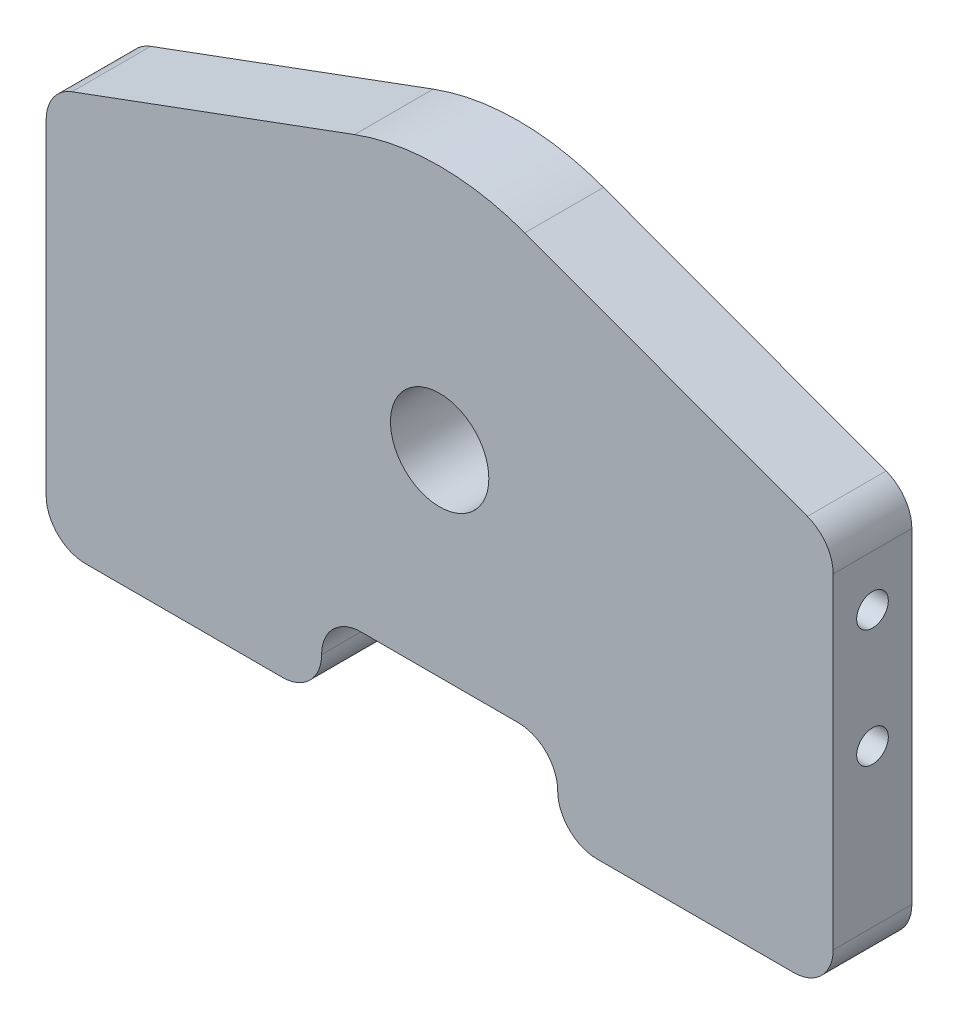
ISO-10303-21;
HEADER;
FILE_DESCRIPTION(('STEP AP214'),'2;1');
FILE_NAME('part.step','',(''),(''),'','','');
FILE_SCHEMA(('AUTOMOTIVE_DESIGN { 1 0 10303 214 1 1 1 1 }'));
ENDSEC;
DATA;
#1=APPLICATION_CONTEXT('core data for automotive mechanical design processes');
#2=APPLICATION_PROTOCOL_DEFINITION('international standard','automotive_design',2000,#1);
#3=PRODUCT_CONTEXT('',#1,'mechanical');
#4=PRODUCT('Part','Part','',(#3));
#5=PRODUCT_RELATED_PRODUCT_CATEGORY('part','',(#4));
#6=PRODUCT_DEFINITION_FORMATION('','',#4);
#7=PRODUCT_DEFINITION_CONTEXT('part definition',#1,'design');
#8=PRODUCT_DEFINITION('design','',#6,#7);
#9=PRODUCT_DEFINITION_SHAPE('','',#8);
#10=(LENGTH_UNIT() NAMED_UNIT(*) SI_UNIT(.MILLI.,.METRE.));
#11=(NAMED_UNIT(*) PLANE_ANGLE_UNIT() SI_UNIT($,.RADIAN.));
#12=(NAMED_UNIT(*) SI_UNIT($,.STERADIAN.) SOLID_ANGLE_UNIT());
#13=UNCERTAINTY_MEASURE_WITH_UNIT(LENGTH_MEASURE(1.E-05),#10,'distance_accuracy_value','');
#14=(GEOMETRIC_REPRESENTATION_CONTEXT(3) GLOBAL_UNCERTAINTY_ASSIGNED_CONTEXT((#13)) GLOBAL_UNIT_ASSIGNED_CONTEXT((#10,
#11,#12)) REPRESENTATION_CONTEXT('',''));
#15=CARTESIAN_POINT('',(0.,0.,0.));
#16=DIRECTION('',(0.,0.,1.));
#17=DIRECTION('',(1.,0.,0.));
#18=AXIS2_PLACEMENT_3D('',#15,#16,#17);
#19=CARTESIAN_POINT('',(-63.5,0.,12.7));
#20=DIRECTION('',(0.,1.,0.));
#21=DIRECTION('',(0.,0.,1.));
#22=AXIS2_PLACEMENT_3D('',#19,#20,#21);
#23=PLANE('',#22);
#24=DIRECTION('',(1.,0.,0.));
#25=VECTOR('',#24,1.);
#26=CARTESIAN_POINT('',(-63.5,0.,12.7));
#27=LINE('',#26,#25);
#28=CARTESIAN_POINT('',(-57.15,0.,12.7));
#29=VERTEX_POINT('',#28);
#30=CARTESIAN_POINT('',(-25.4,0.,12.7));
#31=VERTEX_POINT('',#30);
#32=EDGE_CURVE('E228',#29,#31,#27,.T.);
#33=ORIENTED_EDGE('',*,*,#32,.F.);
#34=DIRECTION('',(0.,0.,-1.));
#35=VECTOR('',#34,1.);
#36=CARTESIAN_POINT('',(-57.15,0.,12.7));
#37=LINE('',#36,#35);
#38=CARTESIAN_POINT('',(-57.15,0.,0.));
#39=VERTEX_POINT('',#38);
#40=EDGE_CURVE('E281',#29,#39,#37,.T.);
#41=ORIENTED_EDGE('',*,*,#40,.T.);
#42=DIRECTION('',(1.,0.,0.));
#43=VECTOR('',#42,1.);
#44=CARTESIAN_POINT('',(-63.5,0.,0.));
#45=LINE('',#44,#43);
#46=CARTESIAN_POINT('',(-25.4,0.,0.));
#47=VERTEX_POINT('',#46);
#48=EDGE_CURVE('E236',#39,#47,#45,.T.);
#49=ORIENTED_EDGE('',*,*,#48,.T.);
#50=DIRECTION('',(0.,0.,1.));
#51=VECTOR('',#50,1.);
#52=CARTESIAN_POINT('',(-25.4,0.,12.7));
#53=LINE('',#52,#51);
#54=EDGE_CURVE('E279',#47,#31,#53,.T.);
#55=ORIENTED_EDGE('',*,*,#54,.T.);
#56=EDGE_LOOP('',(#33,#41,#49,#55));
#57=FACE_BOUND('',#56,.T.);
#58=ADVANCED_FACE('F33',(#57),#23,.F.);
#59=CARTESIAN_POINT('',(63.5,0.,12.7));
#60=DIRECTION('',(-1.,0.,0.));
#61=DIRECTION('',(0.,0.,1.));
#62=AXIS2_PLACEMENT_3D('',#59,#60,#61);
#63=PLANE('',#62);
#64=CARTESIAN_POINT('',(63.5,50.7135001190819,6.35));
#65=DIRECTION('',(1.,0.,0.));
#66=DIRECTION('',(0.,0.,-1.));
#67=AXIS2_PLACEMENT_3D('',#64,#65,#66);
#68=CIRCLE('',#67,2.55269999999999);
#69=CARTESIAN_POINT('',(63.5,50.7135001190819,3.79730000000001));
#70=VERTEX_POINT('',#69);
#71=EDGE_CURVE('E182',#70,#70,#68,.T.);
#72=ORIENTED_EDGE('',*,*,#71,.F.);
#73=EDGE_LOOP('',(#72));
#74=FACE_BOUND('',#73,.T.);
#75=CARTESIAN_POINT('',(63.5,31.6635001190819,6.35));
#76=DIRECTION('',(1.,0.,0.));
#77=DIRECTION('',(0.,0.,-1.));
#78=AXIS2_PLACEMENT_3D('',#75,#76,#77);
#79=CIRCLE('',#78,2.55269999999999);
#80=CARTESIAN_POINT('',(63.5,31.6635001190819,3.79730000000001));
#81=VERTEX_POINT('',#80);
#82=EDGE_CURVE('E188',#81,#81,#79,.T.);
#83=ORIENTED_EDGE('',*,*,#82,.F.);
#84=EDGE_LOOP('',(#83));
#85=FACE_BOUND('',#84,.T.);
#86=DIRECTION('',(0.,1.,0.));
#87=VECTOR('',#86,1.);
#88=CARTESIAN_POINT('',(63.5,0.,12.7));
#89=LINE('',#88,#87);
#90=CARTESIAN_POINT('',(63.5,6.35,12.7));
#91=VERTEX_POINT('',#90);
#92=CARTESIAN_POINT('',(63.5,58.9011925682668,12.7));
#93=VERTEX_POINT('',#92);
#94=EDGE_CURVE('E229',#91,#93,#89,.T.);
#95=ORIENTED_EDGE('',*,*,#94,.F.);
#96=DIRECTION('',(0.,0.,-1.));
#97=VECTOR('',#96,1.);
#98=CARTESIAN_POINT('',(63.5,6.35,12.7));
#99=LINE('',#98,#97);
#100=CARTESIAN_POINT('',(63.5,6.35,0.));
#101=VERTEX_POINT('',#100);
#102=EDGE_CURVE('E274',#91,#101,#99,.T.);
#103=ORIENTED_EDGE('',*,*,#102,.T.);
#104=DIRECTION('',(0.,1.,0.));
#105=VECTOR('',#104,1.);
#106=CARTESIAN_POINT('',(63.5,0.,0.));
#107=LINE('',#106,#105);
#108=CARTESIAN_POINT('',(63.5,58.9011925682668,0.));
#109=VERTEX_POINT('',#108);
#110=EDGE_CURVE('E225',#101,#109,#107,.T.);
#111=ORIENTED_EDGE('',*,*,#110,.T.);
#112=DIRECTION('',(0.,0.,1.));
#113=VECTOR('',#112,1.);
#114=CARTESIAN_POINT('',(63.5,58.9011925682669,12.7));
#115=LINE('',#114,#113);
#116=EDGE_CURVE('E271',#109,#93,#115,.T.);
#117=ORIENTED_EDGE('',*,*,#116,.T.);
#118=EDGE_LOOP('',(#95,#103,#111,#117));
#119=FACE_BOUND('',#118,.T.);
#120=ADVANCED_FACE('F325',(#74,#85,#119),#63,.F.);
#121=CARTESIAN_POINT('',(-63.5,0.,12.7));
#122=DIRECTION('',(1.,0.,0.));
#123=DIRECTION('',(0.,0.,-1.));
#124=AXIS2_PLACEMENT_3D('',#121,#122,#123);
#125=PLANE('',#124);
#126=CARTESIAN_POINT('',(-63.5,50.7135001190819,6.35));
#127=DIRECTION('',(-1.,0.,0.));
#128=DIRECTION('',(0.,0.,1.));
#129=AXIS2_PLACEMENT_3D('',#126,#127,#128);
#130=CIRCLE('',#129,2.55269999999999);
#131=CARTESIAN_POINT('',(-63.5,50.7135001190819,8.90269999999999));
#132=VERTEX_POINT('',#131);
#133=EDGE_CURVE('E170',#132,#132,#130,.T.);
#134=ORIENTED_EDGE('',*,*,#133,.F.);
#135=EDGE_LOOP('',(#134));
#136=FACE_BOUND('',#135,.T.);
#137=CARTESIAN_POINT('',(-63.5,31.6635001190819,6.35));
#138=DIRECTION('',(-1.,0.,0.));
#139=DIRECTION('',(0.,0.,1.));
#140=AXIS2_PLACEMENT_3D('',#137,#138,#139);
#141=CIRCLE('',#140,2.55269999999999);
#142=CARTESIAN_POINT('',(-63.5,31.6635001190819,8.90269999999999));
#143=VERTEX_POINT('',#142);
#144=EDGE_CURVE('E169',#143,#143,#141,.T.);
#145=ORIENTED_EDGE('',*,*,#144,.F.);
#146=EDGE_LOOP('',(#145));
#147=FACE_BOUND('',#146,.T.);
#148=DIRECTION('',(0.,-1.,0.));
#149=VECTOR('',#148,1.);
#150=CARTESIAN_POINT('',(-63.5,0.,0.));
#151=LINE('',#150,#149);
#152=CARTESIAN_POINT('',(-63.5,58.9011925682667,0.));
#153=VERTEX_POINT('',#152);
#154=CARTESIAN_POINT('',(-63.5,6.35,0.));
#155=VERTEX_POINT('',#154);
#156=EDGE_CURVE('E218',#153,#155,#151,.T.);
#157=ORIENTED_EDGE('',*,*,#156,.T.);
#158=DIRECTION('',(0.,0.,-1.));
#159=VECTOR('',#158,1.);
#160=CARTESIAN_POINT('',(-63.5,6.35,12.7));
#161=LINE('',#160,#159);
#162=CARTESIAN_POINT('',(-63.5,6.35,12.7));
#163=VERTEX_POINT('',#162);
#164=EDGE_CURVE('E286',#155,#163,#161,.F.);
#165=ORIENTED_EDGE('',*,*,#164,.T.);
#166=DIRECTION('',(0.,-1.,0.));
#167=VECTOR('',#166,1.);
#168=CARTESIAN_POINT('',(-63.5,0.,12.7));
#169=LINE('',#168,#167);
#170=CARTESIAN_POINT('',(-63.5,58.9011925682667,12.7));
#171=VERTEX_POINT('',#170);
#172=EDGE_CURVE('E221',#171,#163,#169,.T.);
#173=ORIENTED_EDGE('',*,*,#172,.F.);
#174=DIRECTION('',(0.,0.,1.));
#175=VECTOR('',#174,1.);
#176=CARTESIAN_POINT('',(-63.5,58.9011925682667,12.7));
#177=LINE('',#176,#175);
#178=EDGE_CURVE('E284',#171,#153,#177,.F.);
#179=ORIENTED_EDGE('',*,*,#178,.T.);
#180=EDGE_LOOP('',(#157,#165,#173,#179));
#181=FACE_BOUND('',#180,.T.);
#182=ADVANCED_FACE('F350',(#136,#147,#181),#125,.F.);
#183=CARTESIAN_POINT('',(25.4,0.,12.7));
#184=VERTEX_POINT('',#183);
#185=CARTESIAN_POINT('',(57.15,0.,12.7));
#186=VERTEX_POINT('',#185);
#187=EDGE_CURVE('E224',#184,#186,#27,.T.);
#188=ORIENTED_EDGE('',*,*,#187,.F.);
#189=DIRECTION('',(0.,0.,1.));
#190=VECTOR('',#189,1.);
#191=CARTESIAN_POINT('',(25.4,0.,12.7));
#192=LINE('',#191,#190);
#193=CARTESIAN_POINT('',(25.4,0.,0.));
#194=VERTEX_POINT('',#193);
#195=EDGE_CURVE('E259',#184,#194,#192,.F.);
#196=ORIENTED_EDGE('',*,*,#195,.T.);
#197=CARTESIAN_POINT('',(57.15,0.,0.));
#198=VERTEX_POINT('',#197);
#199=EDGE_CURVE('E235',#194,#198,#45,.T.);
#200=ORIENTED_EDGE('',*,*,#199,.T.);
#201=DIRECTION('',(0.,0.,-1.));
#202=VECTOR('',#201,1.);
#203=CARTESIAN_POINT('',(57.15,0.,12.7));
#204=LINE('',#203,#202);
#205=EDGE_CURVE('E257',#198,#186,#204,.F.);
#206=ORIENTED_EDGE('',*,*,#205,.T.);
#207=EDGE_LOOP('',(#188,#196,#200,#206));
#208=FACE_BOUND('',#207,.T.);
#209=ADVANCED_FACE('F317',(#208),#23,.F.);
#210=CARTESIAN_POINT('',(0.,0.,12.7));
#211=DIRECTION('',(0.,0.,-1.));
#212=DIRECTION('',(-1.,0.,0.));
#213=AXIS2_PLACEMENT_3D('',#210,#211,#212);
#214=PLANE('',#213);
#215=CARTESIAN_POINT('',(0.,44.4499999999997,12.7));
#216=DIRECTION('',(0.,0.,1.));
#217=DIRECTION('',(1.,0.,0.));
#218=AXIS2_PLACEMENT_3D('',#215,#216,#217);
#219=CIRCLE('',#218,7.9375);
#220=CARTESIAN_POINT('',(7.93749999999995,44.4499999999997,12.7));
#221=VERTEX_POINT('',#220);
#222=EDGE_CURVE('E194',#221,#221,#219,.T.);
#223=ORIENTED_EDGE('',*,*,#222,.F.);
#224=EDGE_LOOP('',(#223));
#225=FACE_BOUND('',#224,.T.);
#226=DIRECTION('',(-1.,0.,0.));
#227=VECTOR('',#226,1.);
#228=CARTESIAN_POINT('',(-19.05,12.7,12.7));
#229=LINE('',#228,#227);
#230=CARTESIAN_POINT('',(12.7,12.7,12.7));
#231=VERTEX_POINT('',#230);
#232=CARTESIAN_POINT('',(-12.7,12.7,12.7));
#233=VERTEX_POINT('',#232);
#234=EDGE_CURVE('E297',#231,#233,#229,.T.);
#235=ORIENTED_EDGE('',*,*,#234,.F.);
#236=CARTESIAN_POINT('',(12.7,6.35,12.7));
#237=DIRECTION('',(0.,0.,-1.));
#238=DIRECTION('',(-1.,0.,0.));
#239=AXIS2_PLACEMENT_3D('',#236,#237,#238);
#240=CIRCLE('',#239,6.35);
#241=CARTESIAN_POINT('',(19.05,6.35,12.7));
#242=VERTEX_POINT('',#241);
#243=EDGE_CURVE('E42',#231,#242,#240,.T.);
#244=ORIENTED_EDGE('',*,*,#243,.T.);
#245=CARTESIAN_POINT('',(25.4,6.35,12.7));
#246=DIRECTION('',(0.,0.,-1.));
#247=DIRECTION('',(-1.,0.,0.));
#248=AXIS2_PLACEMENT_3D('',#245,#246,#247);
#249=CIRCLE('',#248,6.35);
#250=EDGE_CURVE('E255',#242,#184,#249,.F.);
#251=ORIENTED_EDGE('',*,*,#250,.T.);
#252=ORIENTED_EDGE('',*,*,#187,.T.);
#253=CARTESIAN_POINT('',(57.15,6.35,12.7));
#254=DIRECTION('',(0.,0.,-1.));
#255=DIRECTION('',(-1.,0.,0.));
#256=AXIS2_PLACEMENT_3D('',#253,#254,#255);
#257=CIRCLE('',#256,6.35);
#258=EDGE_CURVE('E253',#186,#91,#257,.F.);
#259=ORIENTED_EDGE('',*,*,#258,.T.);
#260=ORIENTED_EDGE('',*,*,#94,.T.);
#261=CARTESIAN_POINT('',(57.15,58.9011925682669,12.7));
#262=DIRECTION('',(0.,0.,-1.));
#263=DIRECTION('',(-1.,0.,0.));
#264=AXIS2_PLACEMENT_3D('',#261,#262,#263);
#265=CIRCLE('',#264,6.35);
#266=CARTESIAN_POINT('',(59.3477117665924,64.8587560795507,12.7));
#267=VERTEX_POINT('',#266);
#268=EDGE_CURVE('E251',#93,#267,#265,.F.);
#269=ORIENTED_EDGE('',*,*,#268,.T.);
#270=DIRECTION('',(-0.938198978154946,0.346096341195649,0.));
#271=VECTOR('',#270,1.);
#272=CARTESIAN_POINT('',(28.1689350770747,76.3604319355824,12.7));
#273=LINE('',#272,#271);
#274=CARTESIAN_POINT('',(13.7356985412023,81.6847719455241,12.7));
#275=VERTEX_POINT('',#274);
#276=EDGE_CURVE('E212',#267,#275,#273,.T.);
#277=ORIENTED_EDGE('',*,*,#276,.T.);
#278=CARTESIAN_POINT('',(0.,44.4499999999997,12.7));
#279=DIRECTION('',(0.,0.,1.));
#280=DIRECTION('',(1.,0.,0.));
#281=AXIS2_PLACEMENT_3D('',#278,#279,#280);
#282=CIRCLE('',#281,39.6875);
#283=CARTESIAN_POINT('',(-13.7356985412025,81.684771945524,12.7));
#284=VERTEX_POINT('',#283);
#285=EDGE_CURVE('E198',#275,#284,#282,.T.);
#286=ORIENTED_EDGE('',*,*,#285,.T.);
#287=DIRECTION('',(0.938198978154945,0.346096341195652,0.));
#288=VECTOR('',#287,1.);
#289=CARTESIAN_POINT('',(-28.1689350770749,76.3604319355823,12.7));
#290=LINE('',#289,#288);
#291=CARTESIAN_POINT('',(-59.3477117665924,64.8587560795506,12.7));
#292=VERTEX_POINT('',#291);
#293=EDGE_CURVE('E205',#292,#284,#290,.T.);
#294=ORIENTED_EDGE('',*,*,#293,.F.);
#295=CARTESIAN_POINT('',(-57.15,58.9011925682667,12.7));
#296=DIRECTION('',(0.,0.,-1.));
#297=DIRECTION('',(-1.,0.,0.));
#298=AXIS2_PLACEMENT_3D('',#295,#296,#297);
#299=CIRCLE('',#298,6.35);
#300=EDGE_CURVE('E245',#292,#171,#299,.F.);
#301=ORIENTED_EDGE('',*,*,#300,.T.);
#302=ORIENTED_EDGE('',*,*,#172,.T.);
#303=CARTESIAN_POINT('',(-57.15,6.35,12.7));
#304=DIRECTION('',(0.,0.,-1.));
#305=DIRECTION('',(-1.,0.,0.));
#306=AXIS2_PLACEMENT_3D('',#303,#304,#305);
#307=CIRCLE('',#306,6.35);
#308=EDGE_CURVE('E249',#163,#29,#307,.F.);
#309=ORIENTED_EDGE('',*,*,#308,.T.);
#310=ORIENTED_EDGE('',*,*,#32,.T.);
#311=CARTESIAN_POINT('',(-25.4,6.35,12.7));
#312=DIRECTION('',(0.,0.,-1.));
#313=DIRECTION('',(-1.,0.,0.));
#314=AXIS2_PLACEMENT_3D('',#311,#312,#313);
#315=CIRCLE('',#314,6.35);
#316=CARTESIAN_POINT('',(-19.05,6.35,12.7));
#317=VERTEX_POINT('',#316);
#318=EDGE_CURVE('E247',#31,#317,#315,.F.);
#319=ORIENTED_EDGE('',*,*,#318,.T.);
#320=CARTESIAN_POINT('',(-12.7,6.35,12.7));
#321=DIRECTION('',(0.,0.,-1.));
#322=DIRECTION('',(-1.,0.,0.));
#323=AXIS2_PLACEMENT_3D('',#320,#321,#322);
#324=CIRCLE('',#323,6.35);
#325=EDGE_CURVE('E291',#317,#233,#324,.T.);
#326=ORIENTED_EDGE('',*,*,#325,.T.);
#327=EDGE_LOOP('',(#235,#244,#251,#252,#259,#260,#269,#277,#286,#294,#301,#302,#309,#310,#319,#326));
#328=FACE_BOUND('',#327,.T.);
#329=ADVANCED_FACE('F314',(#225,#328),#214,.F.);
#330=CARTESIAN_POINT('',(0.,0.,0.));
#331=DIRECTION('',(0.,0.,-1.));
#332=DIRECTION('',(-1.,0.,0.));
#333=AXIS2_PLACEMENT_3D('',#330,#331,#332);
#334=PLANE('',#333);
#335=ORIENTED_EDGE('',*,*,#199,.F.);
#336=CARTESIAN_POINT('',(25.4,6.35,0.));
#337=DIRECTION('',(0.,0.,-1.));
#338=DIRECTION('',(-1.,0.,0.));
#339=AXIS2_PLACEMENT_3D('',#336,#337,#338);
#340=CIRCLE('',#339,6.35);
#341=CARTESIAN_POINT('',(19.05,6.35,0.));
#342=VERTEX_POINT('',#341);
#343=EDGE_CURVE('E49',#194,#342,#340,.T.);
#344=ORIENTED_EDGE('',*,*,#343,.T.);
#345=CARTESIAN_POINT('',(12.7,6.35,0.));
#346=DIRECTION('',(0.,0.,-1.));
#347=DIRECTION('',(-1.,0.,0.));
#348=AXIS2_PLACEMENT_3D('',#345,#346,#347);
#349=CIRCLE('',#348,6.35);
#350=CARTESIAN_POINT('',(12.7,12.7,0.));
#351=VERTEX_POINT('',#350);
#352=EDGE_CURVE('E11',#342,#351,#349,.F.);
#353=ORIENTED_EDGE('',*,*,#352,.T.);
#354=DIRECTION('',(-1.,0.,0.));
#355=VECTOR('',#354,1.);
#356=CARTESIAN_POINT('',(-19.05,12.7,0.));
#357=LINE('',#356,#355);
#358=CARTESIAN_POINT('',(-12.7,12.7,0.));
#359=VERTEX_POINT('',#358);
#360=EDGE_CURVE('E176',#351,#359,#357,.T.);
#361=ORIENTED_EDGE('',*,*,#360,.T.);
#362=CARTESIAN_POINT('',(-12.7,6.35,0.));
#363=DIRECTION('',(0.,0.,-1.));
#364=DIRECTION('',(-1.,0.,0.));
#365=AXIS2_PLACEMENT_3D('',#362,#363,#364);
#366=CIRCLE('',#365,6.35);
#367=CARTESIAN_POINT('',(-19.05,6.35,0.));
#368=VERTEX_POINT('',#367);
#369=EDGE_CURVE('E293',#359,#368,#366,.F.);
#370=ORIENTED_EDGE('',*,*,#369,.T.);
#371=CARTESIAN_POINT('',(-25.4,6.35,0.));
#372=DIRECTION('',(0.,0.,-1.));
#373=DIRECTION('',(-1.,0.,0.));
#374=AXIS2_PLACEMENT_3D('',#371,#372,#373);
#375=CIRCLE('',#374,6.35);
#376=EDGE_CURVE('E263',#368,#47,#375,.T.);
#377=ORIENTED_EDGE('',*,*,#376,.T.);
#378=ORIENTED_EDGE('',*,*,#48,.F.);
#379=CARTESIAN_POINT('',(-57.15,6.35,0.));
#380=DIRECTION('',(0.,0.,-1.));
#381=DIRECTION('',(-1.,0.,0.));
#382=AXIS2_PLACEMENT_3D('',#379,#380,#381);
#383=CIRCLE('',#382,6.35);
#384=EDGE_CURVE('E265',#39,#155,#383,.T.);
#385=ORIENTED_EDGE('',*,*,#384,.T.);
#386=ORIENTED_EDGE('',*,*,#156,.F.);
#387=CARTESIAN_POINT('',(-57.15,58.9011925682667,0.));
#388=DIRECTION('',(0.,0.,-1.));
#389=DIRECTION('',(-1.,0.,0.));
#390=AXIS2_PLACEMENT_3D('',#387,#388,#389);
#391=CIRCLE('',#390,6.35);
#392=CARTESIAN_POINT('',(-59.3477117665924,64.8587560795506,0.));
#393=VERTEX_POINT('',#392);
#394=EDGE_CURVE('E261',#153,#393,#391,.T.);
#395=ORIENTED_EDGE('',*,*,#394,.T.);
#396=DIRECTION('',(0.938198978154945,0.346096341195652,0.));
#397=VECTOR('',#396,1.);
#398=CARTESIAN_POINT('',(-28.1689350770749,76.3604319355823,0.));
#399=LINE('',#398,#397);
#400=CARTESIAN_POINT('',(-13.7356985412025,81.684771945524,0.));
#401=VERTEX_POINT('',#400);
#402=EDGE_CURVE('E207',#393,#401,#399,.T.);
#403=ORIENTED_EDGE('',*,*,#402,.T.);
#404=CARTESIAN_POINT('',(0.,44.4499999999997,0.));
#405=DIRECTION('',(0.,0.,1.));
#406=DIRECTION('',(1.,0.,0.));
#407=AXIS2_PLACEMENT_3D('',#404,#405,#406);
#408=CIRCLE('',#407,39.6875);
#409=CARTESIAN_POINT('',(13.7356985412023,81.6847719455241,0.));
#410=VERTEX_POINT('',#409);
#411=EDGE_CURVE('E201',#410,#401,#408,.T.);
#412=ORIENTED_EDGE('',*,*,#411,.F.);
#413=DIRECTION('',(-0.938198978154946,0.346096341195649,0.));
#414=VECTOR('',#413,1.);
#415=CARTESIAN_POINT('',(28.1689350770747,76.3604319355824,0.));
#416=LINE('',#415,#414);
#417=CARTESIAN_POINT('',(59.3477117665924,64.8587560795507,0.));
#418=VERTEX_POINT('',#417);
#419=EDGE_CURVE('E204',#418,#410,#416,.T.);
#420=ORIENTED_EDGE('',*,*,#419,.F.);
#421=CARTESIAN_POINT('',(57.15,58.9011925682669,0.));
#422=DIRECTION('',(0.,0.,-1.));
#423=DIRECTION('',(-1.,0.,0.));
#424=AXIS2_PLACEMENT_3D('',#421,#422,#423);
#425=CIRCLE('',#424,6.35);
#426=EDGE_CURVE('E56',#418,#109,#425,.T.);
#427=ORIENTED_EDGE('',*,*,#426,.T.);
#428=ORIENTED_EDGE('',*,*,#110,.F.);
#429=CARTESIAN_POINT('',(57.15,6.35,0.));
#430=DIRECTION('',(0.,0.,-1.));
#431=DIRECTION('',(-1.,0.,0.));
#432=AXIS2_PLACEMENT_3D('',#429,#430,#431);
#433=CIRCLE('',#432,6.35);
#434=EDGE_CURVE('E268',#101,#198,#433,.T.);
#435=ORIENTED_EDGE('',*,*,#434,.T.);
#436=EDGE_LOOP('',(#335,#344,#353,#361,#370,#377,#378,#385,#386,#395,#403,#412,#420,#427,#428,#435));
#437=FACE_BOUND('',#436,.T.);
#438=CARTESIAN_POINT('',(0.,44.4499999999997,0.));
#439=DIRECTION('',(0.,0.,1.));
#440=DIRECTION('',(1.,0.,0.));
#441=AXIS2_PLACEMENT_3D('',#438,#439,#440);
#442=CIRCLE('',#441,7.9375);
#443=CARTESIAN_POINT('',(7.93749999999995,44.4499999999997,0.));
#444=VERTEX_POINT('',#443);
#445=EDGE_CURVE('E195',#444,#444,#442,.T.);
#446=ORIENTED_EDGE('',*,*,#445,.T.);
#447=EDGE_LOOP('',(#446));
#448=FACE_BOUND('',#447,.T.);
#449=ADVANCED_FACE('F352',(#437,#448),#334,.T.);
#450=CARTESIAN_POINT('',(0.,44.4499999999997,0.));
#451=DIRECTION('',(0.,0.,1.));
#452=DIRECTION('',(1.,0.,0.));
#453=AXIS2_PLACEMENT_3D('',#450,#451,#452);
#454=CYLINDRICAL_SURFACE('',#453,39.6875);
#455=ORIENTED_EDGE('',*,*,#285,.F.);
#456=DIRECTION('',(0.,0.,1.));
#457=VECTOR('',#456,1.);
#458=CARTESIAN_POINT('',(13.7356985412023,81.6847719455241,0.));
#459=LINE('',#458,#457);
#460=EDGE_CURVE('E209',#410,#275,#459,.T.);
#461=ORIENTED_EDGE('',*,*,#460,.F.);
#462=ORIENTED_EDGE('',*,*,#411,.T.);
#463=DIRECTION('',(0.,0.,1.));
#464=VECTOR('',#463,1.);
#465=CARTESIAN_POINT('',(-13.7356985412025,81.684771945524,0.));
#466=LINE('',#465,#464);
#467=EDGE_CURVE('E215',#401,#284,#466,.T.);
#468=ORIENTED_EDGE('',*,*,#467,.T.);
#469=EDGE_LOOP('',(#455,#461,#462,#468));
#470=FACE_BOUND('',#469,.T.);
#471=ADVANCED_FACE('F337',(#470),#454,.T.);
#472=CARTESIAN_POINT('',(-28.1689350770749,76.3604319355823,0.));
#473=DIRECTION('',(0.346096341195652,-0.938198978154945,0.));
#474=DIRECTION('',(0.938198978154945,0.346096341195652,0.));
#475=AXIS2_PLACEMENT_3D('',#472,#473,#474);
#476=PLANE('',#475);
#477=ORIENTED_EDGE('',*,*,#402,.F.);
#478=DIRECTION('',(0.,0.,1.));
#479=VECTOR('',#478,1.);
#480=CARTESIAN_POINT('',(-59.3477117665924,64.8587560795506,0.));
#481=LINE('',#480,#479);
#482=EDGE_CURVE('E288',#393,#292,#481,.T.);
#483=ORIENTED_EDGE('',*,*,#482,.T.);
#484=ORIENTED_EDGE('',*,*,#293,.T.);
#485=ORIENTED_EDGE('',*,*,#467,.F.);
#486=EDGE_LOOP('',(#477,#483,#484,#485));
#487=FACE_BOUND('',#486,.T.);
#488=ADVANCED_FACE('F343',(#487),#476,.F.);
#489=CARTESIAN_POINT('',(28.1689350770747,76.3604319355824,0.));
#490=DIRECTION('',(0.346096341195649,0.938198978154946,0.));
#491=DIRECTION('',(-0.938198978154946,0.346096341195649,0.));
#492=AXIS2_PLACEMENT_3D('',#489,#490,#491);
#493=PLANE('',#492);
#494=ORIENTED_EDGE('',*,*,#276,.F.);
#495=DIRECTION('',(0.,0.,1.));
#496=VECTOR('',#495,1.);
#497=CARTESIAN_POINT('',(59.3477117665924,64.8587560795508,0.));
#498=LINE('',#497,#496);
#499=EDGE_CURVE('E277',#267,#418,#498,.F.);
#500=ORIENTED_EDGE('',*,*,#499,.T.);
#501=ORIENTED_EDGE('',*,*,#419,.T.);
#502=ORIENTED_EDGE('',*,*,#460,.T.);
#503=EDGE_LOOP('',(#494,#500,#501,#502));
#504=FACE_BOUND('',#503,.T.);
#505=ADVANCED_FACE('F332',(#504),#493,.T.);
#506=CARTESIAN_POINT('',(0.,44.4499999999997,0.));
#507=DIRECTION('',(0.,0.,1.));
#508=DIRECTION('',(1.,0.,0.));
#509=AXIS2_PLACEMENT_3D('',#506,#507,#508);
#510=CYLINDRICAL_SURFACE('',#509,7.9375);
#511=ORIENTED_EDGE('',*,*,#445,.F.);
#512=EDGE_LOOP('',(#511));
#513=FACE_BOUND('',#512,.T.);
#514=ORIENTED_EDGE('',*,*,#222,.T.);
#515=EDGE_LOOP('',(#514));
#516=FACE_BOUND('',#515,.T.);
#517=ADVANCED_FACE('F472',(#513,#516),#510,.F.);
#518=CARTESIAN_POINT('',(46.99,31.6635001190819,6.35));
#519=DIRECTION('',(1.,0.,0.));
#520=DIRECTION('',(0.,0.,-1.));
#521=AXIS2_PLACEMENT_3D('',#518,#519,#520);
#522=CONICAL_SURFACE('',#521,2.55269999999998,1.02974425867665);
#523=CARTESIAN_POINT('',(45.4561830978084,31.6635001190819,6.35));
#524=VERTEX_POINT('',#523);
#525=VERTEX_LOOP('',#524);
#526=FACE_BOUND('',#525,.T.);
#527=CARTESIAN_POINT('',(46.99,31.6635001190819,6.35));
#528=DIRECTION('',(1.,0.,0.));
#529=DIRECTION('',(0.,0.,-1.));
#530=AXIS2_PLACEMENT_3D('',#527,#528,#529);
#531=CIRCLE('',#530,2.55269999999998);
#532=CARTESIAN_POINT('',(46.99,31.6635001190819,3.79730000000001));
#533=VERTEX_POINT('',#532);
#534=EDGE_CURVE('E191',#533,#533,#531,.T.);
#535=ORIENTED_EDGE('',*,*,#534,.T.);
#536=EDGE_LOOP('',(#535));
#537=FACE_BOUND('',#536,.T.);
#538=ADVANCED_FACE('F526',(#526,#537),#522,.F.);
#539=CARTESIAN_POINT('',(63.5,31.6635001190819,6.35));
#540=DIRECTION('',(1.,0.,0.));
#541=DIRECTION('',(0.,0.,-1.));
#542=AXIS2_PLACEMENT_3D('',#539,#540,#541);
#543=CYLINDRICAL_SURFACE('',#542,2.55269999999999);
#544=ORIENTED_EDGE('',*,*,#534,.F.);
#545=EDGE_LOOP('',(#544));
#546=FACE_BOUND('',#545,.T.);
#547=ORIENTED_EDGE('',*,*,#82,.T.);
#548=EDGE_LOOP('',(#547));
#549=FACE_BOUND('',#548,.T.);
#550=ADVANCED_FACE('F535',(#546,#549),#543,.F.);
#551=CARTESIAN_POINT('',(46.99,50.7135001190819,6.35));
#552=DIRECTION('',(1.,0.,0.));
#553=DIRECTION('',(0.,0.,-1.));
#554=AXIS2_PLACEMENT_3D('',#551,#552,#553);
#555=CONICAL_SURFACE('',#554,2.55269999999998,1.02974425867665);
#556=CARTESIAN_POINT('',(45.4561830978084,50.7135001190819,6.35));
#557=VERTEX_POINT('',#556);
#558=VERTEX_LOOP('',#557);
#559=FACE_BOUND('',#558,.T.);
#560=CARTESIAN_POINT('',(46.99,50.7135001190819,6.35));
#561=DIRECTION('',(1.,0.,0.));
#562=DIRECTION('',(0.,0.,-1.));
#563=AXIS2_PLACEMENT_3D('',#560,#561,#562);
#564=CIRCLE('',#563,2.55269999999998);
#565=CARTESIAN_POINT('',(46.99,50.7135001190819,3.79730000000001));
#566=VERTEX_POINT('',#565);
#567=EDGE_CURVE('E185',#566,#566,#564,.T.);
#568=ORIENTED_EDGE('',*,*,#567,.T.);
#569=EDGE_LOOP('',(#568));
#570=FACE_BOUND('',#569,.T.);
#571=ADVANCED_FACE('F544',(#559,#570),#555,.F.);
#572=CARTESIAN_POINT('',(63.5,50.7135001190819,6.35));
#573=DIRECTION('',(1.,0.,0.));
#574=DIRECTION('',(0.,0.,-1.));
#575=AXIS2_PLACEMENT_3D('',#572,#573,#574);
#576=CYLINDRICAL_SURFACE('',#575,2.55269999999999);
#577=ORIENTED_EDGE('',*,*,#567,.F.);
#578=EDGE_LOOP('',(#577));
#579=FACE_BOUND('',#578,.T.);
#580=ORIENTED_EDGE('',*,*,#71,.T.);
#581=EDGE_LOOP('',(#580));
#582=FACE_BOUND('',#581,.T.);
#583=ADVANCED_FACE('F553',(#579,#582),#576,.F.);
#584=CARTESIAN_POINT('',(-46.99,31.6635001190819,6.35));
#585=DIRECTION('',(-1.,0.,0.));
#586=DIRECTION('',(0.,0.,1.));
#587=AXIS2_PLACEMENT_3D('',#584,#585,#586);
#588=CONICAL_SURFACE('',#587,2.55269999999998,1.02974425867665);
#589=CARTESIAN_POINT('',(-45.4561830978084,31.6635001190819,6.35));
#590=VERTEX_POINT('',#589);
#591=VERTEX_LOOP('',#590);
#592=FACE_BOUND('',#591,.T.);
#593=CARTESIAN_POINT('',(-46.99,31.6635001190819,6.35));
#594=DIRECTION('',(-1.,0.,0.));
#595=DIRECTION('',(0.,0.,1.));
#596=AXIS2_PLACEMENT_3D('',#593,#594,#595);
#597=CIRCLE('',#596,2.55269999999998);
#598=CARTESIAN_POINT('',(-46.99,31.6635001190819,8.90269999999998));
#599=VERTEX_POINT('',#598);
#600=EDGE_CURVE('E173',#599,#599,#597,.T.);
#601=ORIENTED_EDGE('',*,*,#600,.T.);
#602=EDGE_LOOP('',(#601));
#603=FACE_BOUND('',#602,.T.);
#604=ADVANCED_FACE('F562',(#592,#603),#588,.F.);
#605=CARTESIAN_POINT('',(-63.5,31.6635001190819,6.35));
#606=DIRECTION('',(-1.,0.,0.));
#607=DIRECTION('',(0.,0.,1.));
#608=AXIS2_PLACEMENT_3D('',#605,#606,#607);
#609=CYLINDRICAL_SURFACE('',#608,2.55269999999999);
#610=ORIENTED_EDGE('',*,*,#600,.F.);
#611=EDGE_LOOP('',(#610));
#612=FACE_BOUND('',#611,.T.);
#613=ORIENTED_EDGE('',*,*,#144,.T.);
#614=EDGE_LOOP('',(#613));
#615=FACE_BOUND('',#614,.T.);
#616=ADVANCED_FACE('F163',(#612,#615),#609,.F.);
#617=CARTESIAN_POINT('',(-46.99,50.7135001190819,6.35));
#618=DIRECTION('',(-1.,0.,0.));
#619=DIRECTION('',(0.,0.,1.));
#620=AXIS2_PLACEMENT_3D('',#617,#618,#619);
#621=CONICAL_SURFACE('',#620,2.55269999999998,1.02974425867665);
#622=CARTESIAN_POINT('',(-45.4561830978084,50.7135001190819,6.35));
#623=VERTEX_POINT('',#622);
#624=VERTEX_LOOP('',#623);
#625=FACE_BOUND('',#624,.T.);
#626=CARTESIAN_POINT('',(-46.99,50.7135001190819,6.35));
#627=DIRECTION('',(-1.,0.,0.));
#628=DIRECTION('',(0.,0.,1.));
#629=AXIS2_PLACEMENT_3D('',#626,#627,#628);
#630=CIRCLE('',#629,2.55269999999998);
#631=CARTESIAN_POINT('',(-46.99,50.7135001190819,8.90269999999998));
#632=VERTEX_POINT('',#631);
#633=EDGE_CURVE('E167',#632,#632,#630,.T.);
#634=ORIENTED_EDGE('',*,*,#633,.T.);
#635=EDGE_LOOP('',(#634));
#636=FACE_BOUND('',#635,.T.);
#637=ADVANCED_FACE('F159',(#625,#636),#621,.F.);
#638=CARTESIAN_POINT('',(-63.5,50.7135001190819,6.35));
#639=DIRECTION('',(-1.,0.,0.));
#640=DIRECTION('',(0.,0.,1.));
#641=AXIS2_PLACEMENT_3D('',#638,#639,#640);
#642=CYLINDRICAL_SURFACE('',#641,2.55269999999999);
#643=ORIENTED_EDGE('',*,*,#633,.F.);
#644=EDGE_LOOP('',(#643));
#645=FACE_BOUND('',#644,.T.);
#646=ORIENTED_EDGE('',*,*,#133,.T.);
#647=EDGE_LOOP('',(#646));
#648=FACE_BOUND('',#647,.T.);
#649=ADVANCED_FACE('F162',(#645,#648),#642,.F.);
#650=CARTESIAN_POINT('',(-19.05,12.7,0.));
#651=DIRECTION('',(0.,1.,0.));
#652=DIRECTION('',(-1.,0.,0.));
#653=AXIS2_PLACEMENT_3D('',#650,#651,#652);
#654=PLANE('',#653);
#655=ORIENTED_EDGE('',*,*,#234,.T.);
#656=DIRECTION('',(0.,0.,1.));
#657=VECTOR('',#656,1.);
#658=CARTESIAN_POINT('',(-12.7,12.7,0.));
#659=LINE('',#658,#657);
#660=EDGE_CURVE('E242',#233,#359,#659,.F.);
#661=ORIENTED_EDGE('',*,*,#660,.T.);
#662=ORIENTED_EDGE('',*,*,#360,.F.);
#663=DIRECTION('',(0.,0.,1.));
#664=VECTOR('',#663,1.);
#665=CARTESIAN_POINT('',(12.7,12.7,12.7));
#666=LINE('',#665,#664);
#667=EDGE_CURVE('E232',#351,#231,#666,.T.);
#668=ORIENTED_EDGE('',*,*,#667,.T.);
#669=EDGE_LOOP('',(#655,#661,#662,#668));
#670=FACE_BOUND('',#669,.T.);
#671=ADVANCED_FACE('F370',(#670),#654,.F.);
#672=CARTESIAN_POINT('',(-25.4,6.35,12.7));
#673=DIRECTION('',(0.,0.,1.));
#674=DIRECTION('',(1.,0.,0.));
#675=AXIS2_PLACEMENT_3D('',#672,#673,#674);
#676=CYLINDRICAL_SURFACE('',#675,6.35);
#677=ORIENTED_EDGE('',*,*,#54,.F.);
#678=ORIENTED_EDGE('',*,*,#376,.F.);
#679=DIRECTION('',(0.,0.,1.));
#680=VECTOR('',#679,1.);
#681=CARTESIAN_POINT('',(-19.05,6.35,0.));
#682=LINE('',#681,#680);
#683=EDGE_CURVE('E295',#317,#368,#682,.F.);
#684=ORIENTED_EDGE('',*,*,#683,.F.);
#685=ORIENTED_EDGE('',*,*,#318,.F.);
#686=EDGE_LOOP('',(#677,#678,#684,#685));
#687=FACE_BOUND('',#686,.T.);
#688=ADVANCED_FACE('F365',(#687),#676,.T.);
#689=CARTESIAN_POINT('',(-12.7,6.35,0.));
#690=DIRECTION('',(0.,0.,-1.));
#691=DIRECTION('',(-1.,0.,0.));
#692=AXIS2_PLACEMENT_3D('',#689,#690,#691);
#693=CYLINDRICAL_SURFACE('',#692,6.35);
#694=ORIENTED_EDGE('',*,*,#369,.F.);
#695=ORIENTED_EDGE('',*,*,#660,.F.);
#696=ORIENTED_EDGE('',*,*,#325,.F.);
#697=ORIENTED_EDGE('',*,*,#683,.T.);
#698=EDGE_LOOP('',(#694,#695,#696,#697));
#699=FACE_BOUND('',#698,.T.);
#700=ADVANCED_FACE('F368',(#699),#693,.F.);
#701=CARTESIAN_POINT('',(25.4,6.35,0.));
#702=DIRECTION('',(0.,0.,1.));
#703=DIRECTION('',(1.,0.,0.));
#704=AXIS2_PLACEMENT_3D('',#701,#702,#703);
#705=CYLINDRICAL_SURFACE('',#704,6.35);
#706=DIRECTION('',(0.,0.,1.));
#707=VECTOR('',#706,1.);
#708=CARTESIAN_POINT('',(19.05,6.35,0.));
#709=LINE('',#708,#707);
#710=EDGE_CURVE('E37',#342,#242,#709,.T.);
#711=ORIENTED_EDGE('',*,*,#710,.F.);
#712=ORIENTED_EDGE('',*,*,#343,.F.);
#713=ORIENTED_EDGE('',*,*,#195,.F.);
#714=ORIENTED_EDGE('',*,*,#250,.F.);
#715=EDGE_LOOP('',(#711,#712,#713,#714));
#716=FACE_BOUND('',#715,.T.);
#717=ADVANCED_FACE('F309',(#716),#705,.T.);
#718=CARTESIAN_POINT('',(12.7,6.35,0.));
#719=DIRECTION('',(0.,0.,-1.));
#720=DIRECTION('',(-1.,0.,0.));
#721=AXIS2_PLACEMENT_3D('',#718,#719,#720);
#722=CYLINDRICAL_SURFACE('',#721,6.35);
#723=ORIENTED_EDGE('',*,*,#352,.F.);
#724=ORIENTED_EDGE('',*,*,#710,.T.);
#725=ORIENTED_EDGE('',*,*,#243,.F.);
#726=ORIENTED_EDGE('',*,*,#667,.F.);
#727=EDGE_LOOP('',(#723,#724,#725,#726));
#728=FACE_BOUND('',#727,.T.);
#729=ADVANCED_FACE('F305',(#728),#722,.F.);
#730=CARTESIAN_POINT('',(57.15,6.35,12.7));
#731=DIRECTION('',(0.,0.,-1.));
#732=DIRECTION('',(-1.,0.,0.));
#733=AXIS2_PLACEMENT_3D('',#730,#731,#732);
#734=CYLINDRICAL_SURFACE('',#733,6.35);
#735=ORIENTED_EDGE('',*,*,#258,.F.);
#736=ORIENTED_EDGE('',*,*,#205,.F.);
#737=ORIENTED_EDGE('',*,*,#434,.F.);
#738=ORIENTED_EDGE('',*,*,#102,.F.);
#739=EDGE_LOOP('',(#735,#736,#737,#738));
#740=FACE_BOUND('',#739,.T.);
#741=ADVANCED_FACE('F321',(#740),#734,.T.);
#742=CARTESIAN_POINT('',(57.15,58.9011925682669,12.7));
#743=DIRECTION('',(0.,0.,-1.));
#744=DIRECTION('',(-1.,0.,0.));
#745=AXIS2_PLACEMENT_3D('',#742,#743,#744);
#746=CYLINDRICAL_SURFACE('',#745,6.35);
#747=ORIENTED_EDGE('',*,*,#426,.F.);
#748=ORIENTED_EDGE('',*,*,#499,.F.);
#749=ORIENTED_EDGE('',*,*,#268,.F.);
#750=ORIENTED_EDGE('',*,*,#116,.F.);
#751=EDGE_LOOP('',(#747,#748,#749,#750));
#752=FACE_BOUND('',#751,.T.);
#753=ADVANCED_FACE('F328',(#752),#746,.T.);
#754=CARTESIAN_POINT('',(-57.15,6.35,12.7));
#755=DIRECTION('',(0.,0.,-1.));
#756=DIRECTION('',(-1.,0.,0.));
#757=AXIS2_PLACEMENT_3D('',#754,#755,#756);
#758=CYLINDRICAL_SURFACE('',#757,6.35);
#759=ORIENTED_EDGE('',*,*,#308,.F.);
#760=ORIENTED_EDGE('',*,*,#164,.F.);
#761=ORIENTED_EDGE('',*,*,#384,.F.);
#762=ORIENTED_EDGE('',*,*,#40,.F.);
#763=EDGE_LOOP('',(#759,#760,#761,#762));
#764=FACE_BOUND('',#763,.T.);
#765=ADVANCED_FACE('F358',(#764),#758,.T.);
#766=CARTESIAN_POINT('',(-57.15,58.9011925682667,0.));
#767=DIRECTION('',(0.,0.,1.));
#768=DIRECTION('',(1.,0.,0.));
#769=AXIS2_PLACEMENT_3D('',#766,#767,#768);
#770=CYLINDRICAL_SURFACE('',#769,6.35);
#771=ORIENTED_EDGE('',*,*,#394,.F.);
#772=ORIENTED_EDGE('',*,*,#178,.F.);
#773=ORIENTED_EDGE('',*,*,#300,.F.);
#774=ORIENTED_EDGE('',*,*,#482,.F.);
#775=EDGE_LOOP('',(#771,#772,#773,#774));
#776=FACE_BOUND('',#775,.T.);
#777=ADVANCED_FACE('F35',(#776),#770,.T.);
#778=CLOSED_SHELL('',(#58,#120,#182,#209,#329,#449,#471,#488,#505,#517,#538,#550,#571,#583,#604,
#616,#637,#649,#671,#688,#700,#717,#729,#741,#753,#765,#777));
#779=MANIFOLD_SOLID_BREP('B2',#778);
#780=ADVANCED_BREP_SHAPE_REPRESENTATION('',(#18,#779),#14);
#781=SHAPE_DEFINITION_REPRESENTATION(#9,#780);
ENDSEC;
END-ISO-10303-21;
